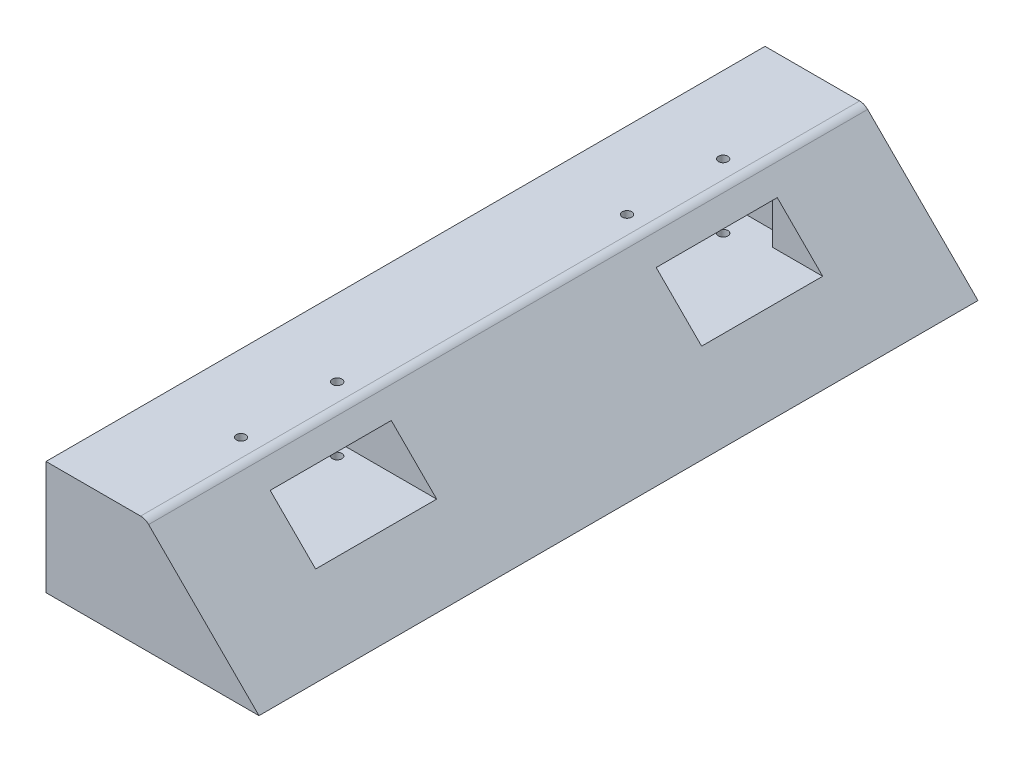
ISO-10303-21;
HEADER;
FILE_DESCRIPTION(('STEP AP214'),'2;1');
FILE_NAME('part.step','',(''),(''),'','','');
FILE_SCHEMA(('AUTOMOTIVE_DESIGN { 1 0 10303 214 1 1 1 1 }'));
ENDSEC;
DATA;
#1=APPLICATION_CONTEXT('core data for automotive mechanical design processes');
#2=APPLICATION_PROTOCOL_DEFINITION('international standard','automotive_design',2000,#1);
#3=PRODUCT_CONTEXT('',#1,'mechanical');
#4=PRODUCT('Part','Part','',(#3));
#5=PRODUCT_RELATED_PRODUCT_CATEGORY('part','',(#4));
#6=PRODUCT_DEFINITION_FORMATION('','',#4);
#7=PRODUCT_DEFINITION_CONTEXT('part definition',#1,'design');
#8=PRODUCT_DEFINITION('design','',#6,#7);
#9=PRODUCT_DEFINITION_SHAPE('','',#8);
#10=(LENGTH_UNIT() NAMED_UNIT(*) SI_UNIT(.MILLI.,.METRE.));
#11=(NAMED_UNIT(*) PLANE_ANGLE_UNIT() SI_UNIT($,.RADIAN.));
#12=(NAMED_UNIT(*) SI_UNIT($,.STERADIAN.) SOLID_ANGLE_UNIT());
#13=UNCERTAINTY_MEASURE_WITH_UNIT(LENGTH_MEASURE(1.E-05),#10,'distance_accuracy_value','');
#14=(GEOMETRIC_REPRESENTATION_CONTEXT(3) GLOBAL_UNCERTAINTY_ASSIGNED_CONTEXT((#13)) GLOBAL_UNIT_ASSIGNED_CONTEXT((#10,
#11,#12)) REPRESENTATION_CONTEXT('',''));
#15=CARTESIAN_POINT('',(0.,0.,0.));
#16=DIRECTION('',(0.,0.,1.));
#17=DIRECTION('',(1.,0.,0.));
#18=AXIS2_PLACEMENT_3D('',#15,#16,#17);
#19=CARTESIAN_POINT('',(20.2426406871193,0.,133.3));
#20=DIRECTION('',(0.,1.,0.));
#21=DIRECTION('',(-1.,0.,0.));
#22=AXIS2_PLACEMENT_3D('',#19,#20,#21);
#23=CYLINDRICAL_SURFACE('',#22,1.25);
#24=CARTESIAN_POINT('',(20.2426406871193,13.0393243800986,133.3));
#25=DIRECTION('',(0.,-1.,0.));
#26=DIRECTION('',(1.,0.,0.));
#27=AXIS2_PLACEMENT_3D('',#24,#25,#26);
#28=CIRCLE('',#27,1.25);
#29=CARTESIAN_POINT('',(21.4926406871193,13.0393243800986,133.3));
#30=VERTEX_POINT('',#29);
#31=EDGE_CURVE('E255',#30,#30,#28,.T.);
#32=ORIENTED_EDGE('',*,*,#31,.F.);
#33=EDGE_LOOP('',(#32));
#34=FACE_BOUND('',#33,.T.);
#35=CARTESIAN_POINT('',(20.2426406871193,8.,133.3));
#36=DIRECTION('',(0.,-1.,0.));
#37=DIRECTION('',(0.,0.,-1.));
#38=AXIS2_PLACEMENT_3D('',#35,#36,#37);
#39=CIRCLE('',#38,1.25);
#40=CARTESIAN_POINT('',(20.2426406871193,8.,132.05));
#41=VERTEX_POINT('',#40);
#42=EDGE_CURVE('E37',#41,#41,#39,.F.);
#43=ORIENTED_EDGE('',*,*,#42,.F.);
#44=EDGE_LOOP('',(#43));
#45=FACE_BOUND('',#44,.T.);
#46=ADVANCED_FACE('F33',(#34,#45),#23,.F.);
#47=CARTESIAN_POINT('',(20.2426406871184,0.,31.2999999999999));
#48=DIRECTION('',(0.,1.,0.));
#49=DIRECTION('',(-1.,0.,0.));
#50=AXIS2_PLACEMENT_3D('',#47,#48,#49);
#51=CYLINDRICAL_SURFACE('',#50,1.25);
#52=CARTESIAN_POINT('',(20.2426406871184,13.0393243800986,31.2999999999999));
#53=DIRECTION('',(0.,-1.,0.));
#54=DIRECTION('',(1.,0.,0.));
#55=AXIS2_PLACEMENT_3D('',#52,#53,#54);
#56=CIRCLE('',#55,1.25);
#57=CARTESIAN_POINT('',(21.4926406871184,13.0393243800986,31.2999999999999));
#58=VERTEX_POINT('',#57);
#59=EDGE_CURVE('E260',#58,#58,#56,.T.);
#60=ORIENTED_EDGE('',*,*,#59,.F.);
#61=EDGE_LOOP('',(#60));
#62=FACE_BOUND('',#61,.T.);
#63=CARTESIAN_POINT('',(20.2426406871184,8.,31.2999999999999));
#64=DIRECTION('',(0.,-1.,0.));
#65=DIRECTION('',(0.,0.,-1.));
#66=AXIS2_PLACEMENT_3D('',#63,#64,#65);
#67=CIRCLE('',#66,1.25);
#68=CARTESIAN_POINT('',(20.2426406871184,8.,30.0499999999999));
#69=VERTEX_POINT('',#68);
#70=EDGE_CURVE('E278',#69,#69,#67,.F.);
#71=ORIENTED_EDGE('',*,*,#70,.F.);
#72=EDGE_LOOP('',(#71));
#73=FACE_BOUND('',#72,.T.);
#74=ADVANCED_FACE('F424',(#62,#73),#51,.F.);
#75=CARTESIAN_POINT('',(20.2426406871183,0.,56.6999999999999));
#76=DIRECTION('',(0.,1.,0.));
#77=DIRECTION('',(-1.,0.,0.));
#78=AXIS2_PLACEMENT_3D('',#75,#76,#77);
#79=CYLINDRICAL_SURFACE('',#78,1.25);
#80=CARTESIAN_POINT('',(20.2426406871183,13.0393243800986,56.6999999999999));
#81=DIRECTION('',(0.,-1.,0.));
#82=DIRECTION('',(1.,0.,0.));
#83=AXIS2_PLACEMENT_3D('',#80,#81,#82);
#84=CIRCLE('',#83,1.25);
#85=CARTESIAN_POINT('',(21.4926406871183,13.0393243800986,56.6999999999999));
#86=VERTEX_POINT('',#85);
#87=EDGE_CURVE('E264',#86,#86,#84,.T.);
#88=ORIENTED_EDGE('',*,*,#87,.F.);
#89=EDGE_LOOP('',(#88));
#90=FACE_BOUND('',#89,.T.);
#91=CARTESIAN_POINT('',(20.2426406871183,8.,56.6999999999999));
#92=DIRECTION('',(0.,-1.,0.));
#93=DIRECTION('',(0.,0.,-1.));
#94=AXIS2_PLACEMENT_3D('',#91,#92,#93);
#95=CIRCLE('',#94,1.25);
#96=CARTESIAN_POINT('',(20.2426406871183,8.,55.4499999999999));
#97=VERTEX_POINT('',#96);
#98=EDGE_CURVE('E275',#97,#97,#95,.F.);
#99=ORIENTED_EDGE('',*,*,#98,.F.);
#100=EDGE_LOOP('',(#99));
#101=FACE_BOUND('',#100,.T.);
#102=ADVANCED_FACE('F431',(#90,#101),#79,.F.);
#103=CARTESIAN_POINT('',(20.2426406871193,0.,158.7));
#104=DIRECTION('',(0.,1.,0.));
#105=DIRECTION('',(-1.,0.,0.));
#106=AXIS2_PLACEMENT_3D('',#103,#104,#105);
#107=CYLINDRICAL_SURFACE('',#106,1.24999999999999);
#108=CARTESIAN_POINT('',(20.2426406871193,13.0393243800986,158.7));
#109=DIRECTION('',(0.,-1.,0.));
#110=DIRECTION('',(1.,0.,0.));
#111=AXIS2_PLACEMENT_3D('',#108,#109,#110);
#112=CIRCLE('',#111,1.24999999999999);
#113=CARTESIAN_POINT('',(21.4926406871193,13.0393243800986,158.7));
#114=VERTEX_POINT('',#113);
#115=EDGE_CURVE('E268',#114,#114,#112,.T.);
#116=ORIENTED_EDGE('',*,*,#115,.F.);
#117=EDGE_LOOP('',(#116));
#118=FACE_BOUND('',#117,.T.);
#119=CARTESIAN_POINT('',(20.2426406871193,8.,158.7));
#120=DIRECTION('',(0.,-1.,0.));
#121=DIRECTION('',(0.,0.,-1.));
#122=AXIS2_PLACEMENT_3D('',#119,#120,#121);
#123=CIRCLE('',#122,1.24999999999999);
#124=CARTESIAN_POINT('',(20.2426406871193,8.,157.45));
#125=VERTEX_POINT('',#124);
#126=EDGE_CURVE('E272',#125,#125,#123,.F.);
#127=ORIENTED_EDGE('',*,*,#126,.F.);
#128=EDGE_LOOP('',(#127));
#129=FACE_BOUND('',#128,.T.);
#130=ADVANCED_FACE('F477',(#118,#129),#107,.F.);
#131=CARTESIAN_POINT('',(56.2819650672182,25.0393243800986,162.));
#132=DIRECTION('',(0.,0.,1.));
#133=DIRECTION('',(1.,0.,0.));
#134=AXIS2_PLACEMENT_3D('',#131,#132,#133);
#135=PLANE('',#134);
#136=DIRECTION('',(0.,-1.,0.));
#137=VECTOR('',#136,1.);
#138=CARTESIAN_POINT('',(30.,25.0393243800986,162.));
#139=LINE('',#138,#137);
#140=CARTESIAN_POINT('',(30.,25.0393243800986,162.));
#141=VERTEX_POINT('',#140);
#142=CARTESIAN_POINT('',(30.,13.0393243800986,162.));
#143=VERTEX_POINT('',#142);
#144=EDGE_CURVE('E50',#141,#143,#139,.T.);
#145=ORIENTED_EDGE('',*,*,#144,.F.);
#146=DIRECTION('',(-1.,0.,0.));
#147=VECTOR('',#146,1.);
#148=CARTESIAN_POINT('',(56.2819650672182,25.0393243800986,162.));
#149=LINE('',#148,#147);
#150=CARTESIAN_POINT('',(31.2426406871193,25.0393243800986,162.));
#151=VERTEX_POINT('',#150);
#152=EDGE_CURVE('E206',#151,#141,#149,.T.);
#153=ORIENTED_EDGE('',*,*,#152,.F.);
#154=DIRECTION('',(-0.707106781186551,0.707106781186544,0.));
#155=VECTOR('',#154,1.);
#156=CARTESIAN_POINT('',(56.2819650672182,0.,162.));
#157=LINE('',#156,#155);
#158=CARTESIAN_POINT('',(43.2426406871194,13.0393243800986,162.));
#159=VERTEX_POINT('',#158);
#160=EDGE_CURVE('E200',#159,#151,#157,.T.);
#161=ORIENTED_EDGE('',*,*,#160,.F.);
#162=DIRECTION('',(1.,0.,0.));
#163=VECTOR('',#162,1.);
#164=CARTESIAN_POINT('',(56.2819650672182,13.0393243800986,162.));
#165=LINE('',#164,#163);
#166=EDGE_CURVE('E11',#143,#159,#165,.T.);
#167=ORIENTED_EDGE('',*,*,#166,.F.);
#168=EDGE_LOOP('',(#145,#153,#161,#167));
#169=FACE_BOUND('',#168,.T.);
#170=ADVANCED_FACE('F396',(#169),#135,.F.);
#171=CARTESIAN_POINT('',(56.2819650672182,25.0393243800986,28.));
#172=DIRECTION('',(0.,0.,-1.));
#173=DIRECTION('',(-1.,0.,0.));
#174=AXIS2_PLACEMENT_3D('',#171,#172,#173);
#175=PLANE('',#174);
#176=DIRECTION('',(1.,0.,0.));
#177=VECTOR('',#176,1.);
#178=CARTESIAN_POINT('',(56.2819650672182,25.0393243800986,28.));
#179=LINE('',#178,#177);
#180=CARTESIAN_POINT('',(30.,25.0393243800986,28.));
#181=VERTEX_POINT('',#180);
#182=CARTESIAN_POINT('',(31.2426406871193,25.0393243800986,28.));
#183=VERTEX_POINT('',#182);
#184=EDGE_CURVE('E173',#181,#183,#179,.T.);
#185=ORIENTED_EDGE('',*,*,#184,.F.);
#186=DIRECTION('',(0.,1.,0.));
#187=VECTOR('',#186,1.);
#188=CARTESIAN_POINT('',(30.,25.0393243800986,28.));
#189=LINE('',#188,#187);
#190=CARTESIAN_POINT('',(30.,13.0393243800986,28.));
#191=VERTEX_POINT('',#190);
#192=EDGE_CURVE('E181',#191,#181,#189,.T.);
#193=ORIENTED_EDGE('',*,*,#192,.F.);
#194=DIRECTION('',(-1.,0.,0.));
#195=VECTOR('',#194,1.);
#196=CARTESIAN_POINT('',(56.2819650672182,13.0393243800986,28.));
#197=LINE('',#196,#195);
#198=CARTESIAN_POINT('',(43.2426406871194,13.0393243800986,28.));
#199=VERTEX_POINT('',#198);
#200=EDGE_CURVE('E343',#199,#191,#197,.T.);
#201=ORIENTED_EDGE('',*,*,#200,.F.);
#202=DIRECTION('',(0.707106781186551,-0.707106781186544,0.));
#203=VECTOR('',#202,1.);
#204=CARTESIAN_POINT('',(56.2819650672182,0.,28.));
#205=LINE('',#204,#203);
#206=EDGE_CURVE('E194',#183,#199,#205,.T.);
#207=ORIENTED_EDGE('',*,*,#206,.F.);
#208=EDGE_LOOP('',(#185,#193,#201,#207));
#209=FACE_BOUND('',#208,.T.);
#210=ADVANCED_FACE('F192',(#209),#175,.F.);
#211=CARTESIAN_POINT('',(56.2819650672182,25.0393243800986,60.));
#212=DIRECTION('',(0.,0.,1.));
#213=DIRECTION('',(1.,0.,0.));
#214=AXIS2_PLACEMENT_3D('',#211,#212,#213);
#215=PLANE('',#214);
#216=DIRECTION('',(1.,0.,0.));
#217=VECTOR('',#216,1.);
#218=CARTESIAN_POINT('',(56.2819650672182,13.0393243800986,60.));
#219=LINE('',#218,#217);
#220=CARTESIAN_POINT('',(15.,13.0393243800987,60.));
#221=VERTEX_POINT('',#220);
#222=CARTESIAN_POINT('',(43.2426406871194,13.0393243800986,60.));
#223=VERTEX_POINT('',#222);
#224=EDGE_CURVE('E341',#221,#223,#219,.T.);
#225=ORIENTED_EDGE('',*,*,#224,.F.);
#226=DIRECTION('',(0.,-1.,0.));
#227=VECTOR('',#226,1.);
#228=CARTESIAN_POINT('',(15.,96.6284296964804,60.));
#229=LINE('',#228,#227);
#230=CARTESIAN_POINT('',(15.,25.0393243800986,60.));
#231=VERTEX_POINT('',#230);
#232=EDGE_CURVE('E351',#231,#221,#229,.T.);
#233=ORIENTED_EDGE('',*,*,#232,.F.);
#234=DIRECTION('',(-1.,0.,0.));
#235=VECTOR('',#234,1.);
#236=CARTESIAN_POINT('',(56.2819650672182,25.0393243800986,60.));
#237=LINE('',#236,#235);
#238=CARTESIAN_POINT('',(31.2426406871193,25.0393243800986,60.));
#239=VERTEX_POINT('',#238);
#240=EDGE_CURVE('E202',#239,#231,#237,.T.);
#241=ORIENTED_EDGE('',*,*,#240,.F.);
#242=DIRECTION('',(-0.707106781186551,0.707106781186544,0.));
#243=VECTOR('',#242,1.);
#244=CARTESIAN_POINT('',(56.2819650672182,0.,60.));
#245=LINE('',#244,#243);
#246=EDGE_CURVE('E217',#223,#239,#245,.T.);
#247=ORIENTED_EDGE('',*,*,#246,.F.);
#248=EDGE_LOOP('',(#225,#233,#241,#247));
#249=FACE_BOUND('',#248,.T.);
#250=ADVANCED_FACE('F374',(#249),#215,.F.);
#251=CARTESIAN_POINT('',(15.,96.6284296964804,130.));
#252=DIRECTION('',(0.707106781186548,0.,-0.707106781186547));
#253=DIRECTION('',(-0.707106781186547,0.,-0.707106781186548));
#254=AXIS2_PLACEMENT_3D('',#251,#252,#253);
#255=PLANE('',#254);
#256=DIRECTION('',(-0.707106781186547,0.,-0.707106781186548));
#257=VECTOR('',#256,1.);
#258=CARTESIAN_POINT('',(15.,13.0393243800987,130.));
#259=LINE('',#258,#257);
#260=CARTESIAN_POINT('',(15.,13.0393243800986,130.));
#261=VERTEX_POINT('',#260);
#262=CARTESIAN_POINT('',(7.92893218813454,13.0393243800987,122.928932188135));
#263=VERTEX_POINT('',#262);
#264=EDGE_CURVE('E339',#261,#263,#259,.T.);
#265=ORIENTED_EDGE('',*,*,#264,.F.);
#266=DIRECTION('',(0.,-1.,0.));
#267=VECTOR('',#266,1.);
#268=CARTESIAN_POINT('',(15.,96.6284296964804,130.));
#269=LINE('',#268,#267);
#270=CARTESIAN_POINT('',(15.,25.0393243800986,130.));
#271=VERTEX_POINT('',#270);
#272=EDGE_CURVE('E355',#271,#261,#269,.T.);
#273=ORIENTED_EDGE('',*,*,#272,.F.);
#274=DIRECTION('',(-0.707106781186547,0.,-0.707106781186548));
#275=VECTOR('',#274,1.);
#276=CARTESIAN_POINT('',(15.,25.0393243800986,130.));
#277=LINE('',#276,#275);
#278=CARTESIAN_POINT('',(7.92893218813454,25.0393243800986,122.928932188135));
#279=VERTEX_POINT('',#278);
#280=EDGE_CURVE('E210',#271,#279,#277,.T.);
#281=ORIENTED_EDGE('',*,*,#280,.T.);
#282=DIRECTION('',(0.,-1.,0.));
#283=VECTOR('',#282,1.);
#284=CARTESIAN_POINT('',(7.92893218813454,96.6284296964804,122.928932188135));
#285=LINE('',#284,#283);
#286=EDGE_CURVE('E359',#279,#263,#285,.T.);
#287=ORIENTED_EDGE('',*,*,#286,.T.);
#288=EDGE_LOOP('',(#265,#273,#281,#287));
#289=FACE_BOUND('',#288,.T.);
#290=ADVANCED_FACE('F385',(#289),#255,.F.);
#291=CARTESIAN_POINT('',(7.92893218813454,96.6284296964804,122.928932188135));
#292=DIRECTION('',(1.,0.,0.));
#293=DIRECTION('',(0.,0.,-1.));
#294=AXIS2_PLACEMENT_3D('',#291,#292,#293);
#295=PLANE('',#294);
#296=DIRECTION('',(0.,0.,-1.));
#297=VECTOR('',#296,1.);
#298=CARTESIAN_POINT('',(7.92893218813454,13.0393243800987,122.928932188135));
#299=LINE('',#298,#297);
#300=CARTESIAN_POINT('',(7.92893218813454,13.0393243800987,67.0710678118655));
#301=VERTEX_POINT('',#300);
#302=EDGE_CURVE('E337',#263,#301,#299,.T.);
#303=ORIENTED_EDGE('',*,*,#302,.F.);
#304=ORIENTED_EDGE('',*,*,#286,.F.);
#305=DIRECTION('',(0.,0.,-1.));
#306=VECTOR('',#305,1.);
#307=CARTESIAN_POINT('',(7.92893218813454,25.0393243800986,122.928932188135));
#308=LINE('',#307,#306);
#309=CARTESIAN_POINT('',(7.92893218813454,25.0393243800986,67.0710678118655));
#310=VERTEX_POINT('',#309);
#311=EDGE_CURVE('E354',#279,#310,#308,.T.);
#312=ORIENTED_EDGE('',*,*,#311,.T.);
#313=DIRECTION('',(0.,-1.,0.));
#314=VECTOR('',#313,1.);
#315=CARTESIAN_POINT('',(7.92893218813454,96.6284296964804,67.0710678118655));
#316=LINE('',#315,#314);
#317=EDGE_CURVE('E362',#310,#301,#316,.T.);
#318=ORIENTED_EDGE('',*,*,#317,.T.);
#319=EDGE_LOOP('',(#303,#304,#312,#318));
#320=FACE_BOUND('',#319,.T.);
#321=ADVANCED_FACE('F380',(#320),#295,.F.);
#322=CARTESIAN_POINT('',(15.,96.6284296964804,60.));
#323=DIRECTION('',(0.707106781186548,0.,0.707106781186547));
#324=DIRECTION('',(0.707106781186547,0.,-0.707106781186548));
#325=AXIS2_PLACEMENT_3D('',#322,#323,#324);
#326=PLANE('',#325);
#327=DIRECTION('',(0.707106781186547,0.,-0.707106781186548));
#328=VECTOR('',#327,1.);
#329=CARTESIAN_POINT('',(15.,13.0393243800987,60.));
#330=LINE('',#329,#328);
#331=EDGE_CURVE('E335',#301,#221,#330,.T.);
#332=ORIENTED_EDGE('',*,*,#331,.F.);
#333=ORIENTED_EDGE('',*,*,#317,.F.);
#334=DIRECTION('',(0.707106781186547,0.,-0.707106781186548));
#335=VECTOR('',#334,1.);
#336=CARTESIAN_POINT('',(15.,25.0393243800986,60.));
#337=LINE('',#336,#335);
#338=EDGE_CURVE('E352',#310,#231,#337,.T.);
#339=ORIENTED_EDGE('',*,*,#338,.T.);
#340=ORIENTED_EDGE('',*,*,#232,.T.);
#341=EDGE_LOOP('',(#332,#333,#339,#340));
#342=FACE_BOUND('',#341,.T.);
#343=ADVANCED_FACE('F377',(#342),#326,.F.);
#344=CARTESIAN_POINT('',(56.2819650672182,25.0393243800986,130.));
#345=DIRECTION('',(0.,0.,-1.));
#346=DIRECTION('',(-1.,0.,0.));
#347=AXIS2_PLACEMENT_3D('',#344,#345,#346);
#348=PLANE('',#347);
#349=DIRECTION('',(-1.,0.,0.));
#350=VECTOR('',#349,1.);
#351=CARTESIAN_POINT('',(0.,13.0393243800986,130.));
#352=LINE('',#351,#350);
#353=CARTESIAN_POINT('',(43.2426406871194,13.0393243800986,130.));
#354=VERTEX_POINT('',#353);
#355=EDGE_CURVE('E58',#354,#261,#352,.T.);
#356=ORIENTED_EDGE('',*,*,#355,.F.);
#357=DIRECTION('',(0.707106781186551,-0.707106781186544,0.));
#358=VECTOR('',#357,1.);
#359=CARTESIAN_POINT('',(56.2819650672182,0.,130.));
#360=LINE('',#359,#358);
#361=CARTESIAN_POINT('',(31.2426406871193,25.0393243800986,130.));
#362=VERTEX_POINT('',#361);
#363=EDGE_CURVE('E213',#362,#354,#360,.T.);
#364=ORIENTED_EDGE('',*,*,#363,.F.);
#365=DIRECTION('',(1.,0.,0.));
#366=VECTOR('',#365,1.);
#367=CARTESIAN_POINT('',(56.2819650672182,25.0393243800986,130.));
#368=LINE('',#367,#366);
#369=EDGE_CURVE('E209',#271,#362,#368,.T.);
#370=ORIENTED_EDGE('',*,*,#369,.F.);
#371=ORIENTED_EDGE('',*,*,#272,.T.);
#372=EDGE_LOOP('',(#356,#364,#370,#371));
#373=FACE_BOUND('',#372,.T.);
#374=ADVANCED_FACE('F386',(#373),#348,.F.);
#375=CARTESIAN_POINT('',(0.,30.0393243800986,190.));
#376=DIRECTION('',(1.,0.,0.));
#377=DIRECTION('',(0.,0.,-1.));
#378=AXIS2_PLACEMENT_3D('',#375,#376,#377);
#379=PLANE('',#378);
#380=DIRECTION('',(0.,-1.,0.));
#381=VECTOR('',#380,1.);
#382=CARTESIAN_POINT('',(0.,30.0393243800986,0.));
#383=LINE('',#382,#381);
#384=CARTESIAN_POINT('',(0.,30.0393243800986,0.));
#385=VERTEX_POINT('',#384);
#386=CARTESIAN_POINT('',(0.,0.,0.));
#387=VERTEX_POINT('',#386);
#388=EDGE_CURVE('E225',#385,#387,#383,.T.);
#389=ORIENTED_EDGE('',*,*,#388,.T.);
#390=DIRECTION('',(0.,0.,-1.));
#391=VECTOR('',#390,1.);
#392=CARTESIAN_POINT('',(0.,0.,190.));
#393=LINE('',#392,#391);
#394=CARTESIAN_POINT('',(0.,0.,190.));
#395=VERTEX_POINT('',#394);
#396=EDGE_CURVE('E233',#395,#387,#393,.T.);
#397=ORIENTED_EDGE('',*,*,#396,.F.);
#398=DIRECTION('',(0.,-1.,0.));
#399=VECTOR('',#398,1.);
#400=CARTESIAN_POINT('',(0.,30.0393243800986,190.));
#401=LINE('',#400,#399);
#402=CARTESIAN_POINT('',(0.,30.0393243800986,190.));
#403=VERTEX_POINT('',#402);
#404=EDGE_CURVE('E231',#403,#395,#401,.T.);
#405=ORIENTED_EDGE('',*,*,#404,.F.);
#406=DIRECTION('',(0.,0.,-1.));
#407=VECTOR('',#406,1.);
#408=CARTESIAN_POINT('',(0.,30.0393243800986,190.));
#409=LINE('',#408,#407);
#410=EDGE_CURVE('E245',#403,#385,#409,.T.);
#411=ORIENTED_EDGE('',*,*,#410,.T.);
#412=EDGE_LOOP('',(#389,#397,#405,#411));
#413=FACE_BOUND('',#412,.T.);
#414=DIRECTION('',(0.,0.,-1.));
#415=VECTOR('',#414,1.);
#416=CARTESIAN_POINT('',(0.,13.0393243800986,190.));
#417=LINE('',#416,#415);
#418=CARTESIAN_POINT('',(0.,13.0393243800986,166.));
#419=VERTEX_POINT('',#418);
#420=CARTESIAN_POINT('',(0.,13.0393243800986,24.));
#421=VERTEX_POINT('',#420);
#422=EDGE_CURVE('E346',#419,#421,#417,.T.);
#423=ORIENTED_EDGE('',*,*,#422,.T.);
#424=DIRECTION('',(0.,-1.,0.));
#425=VECTOR('',#424,1.);
#426=CARTESIAN_POINT('',(0.,25.0393243800986,24.));
#427=LINE('',#426,#425);
#428=CARTESIAN_POINT('',(0.,25.0393243800986,24.));
#429=VERTEX_POINT('',#428);
#430=EDGE_CURVE('E190',#429,#421,#427,.T.);
#431=ORIENTED_EDGE('',*,*,#430,.F.);
#432=DIRECTION('',(0.,0.,-1.));
#433=VECTOR('',#432,1.);
#434=CARTESIAN_POINT('',(0.,25.0393243800986,60.));
#435=LINE('',#434,#433);
#436=CARTESIAN_POINT('',(0.,25.0393243800986,166.));
#437=VERTEX_POINT('',#436);
#438=EDGE_CURVE('E197',#437,#429,#435,.T.);
#439=ORIENTED_EDGE('',*,*,#438,.F.);
#440=DIRECTION('',(0.,1.,0.));
#441=VECTOR('',#440,1.);
#442=CARTESIAN_POINT('',(0.,25.0393243800986,166.));
#443=LINE('',#442,#441);
#444=EDGE_CURVE('E306',#419,#437,#443,.T.);
#445=ORIENTED_EDGE('',*,*,#444,.F.);
#446=EDGE_LOOP('',(#423,#431,#439,#445));
#447=FACE_BOUND('',#446,.T.);
#448=ADVANCED_FACE('F406',(#413,#447),#379,.F.);
#449=CARTESIAN_POINT('',(0.,0.,190.));
#450=DIRECTION('',(0.,1.,0.));
#451=DIRECTION('',(0.,0.,1.));
#452=AXIS2_PLACEMENT_3D('',#449,#450,#451);
#453=PLANE('',#452);
#454=CARTESIAN_POINT('',(20.2426406871193,0.,158.7));
#455=DIRECTION('',(0.,-1.,0.));
#456=DIRECTION('',(0.,0.,-1.));
#457=AXIS2_PLACEMENT_3D('',#454,#455,#456);
#458=CIRCLE('',#457,3.5);
#459=CARTESIAN_POINT('',(20.2426406871193,0.,155.2));
#460=VERTEX_POINT('',#459);
#461=EDGE_CURVE('E597',#460,#460,#458,.T.);
#462=ORIENTED_EDGE('',*,*,#461,.F.);
#463=EDGE_LOOP('',(#462));
#464=FACE_BOUND('',#463,.T.);
#465=CARTESIAN_POINT('',(20.2426406871193,0.,133.3));
#466=DIRECTION('',(0.,-1.,0.));
#467=DIRECTION('',(0.,0.,-1.));
#468=AXIS2_PLACEMENT_3D('',#465,#466,#467);
#469=CIRCLE('',#468,3.49999999999999);
#470=CARTESIAN_POINT('',(20.2426406871193,0.,129.8));
#471=VERTEX_POINT('',#470);
#472=EDGE_CURVE('E591',#471,#471,#469,.T.);
#473=ORIENTED_EDGE('',*,*,#472,.F.);
#474=EDGE_LOOP('',(#473));
#475=FACE_BOUND('',#474,.T.);
#476=CARTESIAN_POINT('',(20.2426406871183,0.,56.6999999999999));
#477=DIRECTION('',(0.,-1.,0.));
#478=DIRECTION('',(0.,0.,-1.));
#479=AXIS2_PLACEMENT_3D('',#476,#477,#478);
#480=CIRCLE('',#479,3.5);
#481=CARTESIAN_POINT('',(20.2426406871183,0.,53.1999999999999));
#482=VERTEX_POINT('',#481);
#483=EDGE_CURVE('E584',#482,#482,#480,.T.);
#484=ORIENTED_EDGE('',*,*,#483,.F.);
#485=EDGE_LOOP('',(#484));
#486=FACE_BOUND('',#485,.T.);
#487=CARTESIAN_POINT('',(20.2426406871184,0.,31.2999999999999));
#488=DIRECTION('',(0.,-1.,0.));
#489=DIRECTION('',(0.,0.,-1.));
#490=AXIS2_PLACEMENT_3D('',#487,#488,#489);
#491=CIRCLE('',#490,3.5);
#492=CARTESIAN_POINT('',(20.2426406871184,0.,27.7999999999999));
#493=VERTEX_POINT('',#492);
#494=EDGE_CURVE('E582',#493,#493,#491,.T.);
#495=ORIENTED_EDGE('',*,*,#494,.F.);
#496=EDGE_LOOP('',(#495));
#497=FACE_BOUND('',#496,.T.);
#498=DIRECTION('',(1.,0.,0.));
#499=VECTOR('',#498,1.);
#500=CARTESIAN_POINT('',(0.,0.,0.));
#501=LINE('',#500,#499);
#502=CARTESIAN_POINT('',(56.2819650672182,0.,0.));
#503=VERTEX_POINT('',#502);
#504=EDGE_CURVE('E220',#387,#503,#501,.T.);
#505=ORIENTED_EDGE('',*,*,#504,.T.);
#506=DIRECTION('',(0.,0.,-1.));
#507=VECTOR('',#506,1.);
#508=CARTESIAN_POINT('',(56.2819650672182,0.,190.));
#509=LINE('',#508,#507);
#510=CARTESIAN_POINT('',(56.2819650672182,0.,190.));
#511=VERTEX_POINT('',#510);
#512=EDGE_CURVE('E42',#511,#503,#509,.T.);
#513=ORIENTED_EDGE('',*,*,#512,.F.);
#514=DIRECTION('',(1.,0.,0.));
#515=VECTOR('',#514,1.);
#516=CARTESIAN_POINT('',(0.,0.,190.));
#517=LINE('',#516,#515);
#518=EDGE_CURVE('E221',#395,#511,#517,.T.);
#519=ORIENTED_EDGE('',*,*,#518,.F.);
#520=ORIENTED_EDGE('',*,*,#396,.T.);
#521=EDGE_LOOP('',(#505,#513,#519,#520));
#522=FACE_BOUND('',#521,.T.);
#523=ADVANCED_FACE('F35',(#464,#475,#486,#497,#522),#453,.F.);
#524=CARTESIAN_POINT('',(56.2819650672182,0.,190.));
#525=DIRECTION('',(-0.707106781186544,-0.707106781186551,0.));
#526=DIRECTION('',(0.707106781186551,-0.707106781186544,0.));
#527=AXIS2_PLACEMENT_3D('',#524,#525,#526);
#528=PLANE('',#527);
#529=ORIENTED_EDGE('',*,*,#206,.T.);
#530=DIRECTION('',(0.,0.,1.));
#531=VECTOR('',#530,1.);
#532=CARTESIAN_POINT('',(43.2426406871194,13.0393243800986,0.));
#533=LINE('',#532,#531);
#534=EDGE_CURVE('E316',#199,#223,#533,.T.);
#535=ORIENTED_EDGE('',*,*,#534,.T.);
#536=ORIENTED_EDGE('',*,*,#246,.T.);
#537=DIRECTION('',(0.,0.,-1.));
#538=VECTOR('',#537,1.);
#539=CARTESIAN_POINT('',(31.2426406871193,25.0393243800986,190.));
#540=LINE('',#539,#538);
#541=EDGE_CURVE('E215',#239,#183,#540,.T.);
#542=ORIENTED_EDGE('',*,*,#541,.T.);
#543=EDGE_LOOP('',(#529,#535,#536,#542));
#544=FACE_BOUND('',#543,.T.);
#545=ORIENTED_EDGE('',*,*,#363,.T.);
#546=DIRECTION('',(0.,0.,-1.));
#547=VECTOR('',#546,1.);
#548=CARTESIAN_POINT('',(43.2426406871195,13.0393243800986,190.));
#549=LINE('',#548,#547);
#550=EDGE_CURVE('E348',#159,#354,#549,.T.);
#551=ORIENTED_EDGE('',*,*,#550,.F.);
#552=ORIENTED_EDGE('',*,*,#160,.T.);
#553=DIRECTION('',(0.,0.,1.));
#554=VECTOR('',#553,1.);
#555=CARTESIAN_POINT('',(31.2426406871193,25.0393243800986,190.));
#556=LINE('',#555,#554);
#557=EDGE_CURVE('E196',#362,#151,#556,.T.);
#558=ORIENTED_EDGE('',*,*,#557,.F.);
#559=EDGE_LOOP('',(#545,#551,#552,#558));
#560=FACE_BOUND('',#559,.T.);
#561=ORIENTED_EDGE('',*,*,#512,.T.);
#562=DIRECTION('',(-0.707106781186551,0.707106781186544,0.));
#563=VECTOR('',#562,1.);
#564=CARTESIAN_POINT('',(56.2819650672182,0.,0.));
#565=LINE('',#564,#563);
#566=CARTESIAN_POINT('',(27.1213203435596,29.1606447236583,0.));
#567=VERTEX_POINT('',#566);
#568=EDGE_CURVE('E236',#503,#567,#565,.T.);
#569=ORIENTED_EDGE('',*,*,#568,.T.);
#570=DIRECTION('',(0.,0.,-1.));
#571=VECTOR('',#570,1.);
#572=CARTESIAN_POINT('',(27.1213203435596,29.1606447236583,190.));
#573=LINE('',#572,#571);
#574=CARTESIAN_POINT('',(27.1213203435596,29.1606447236583,190.));
#575=VERTEX_POINT('',#574);
#576=EDGE_CURVE('E251',#575,#567,#573,.T.);
#577=ORIENTED_EDGE('',*,*,#576,.F.);
#578=DIRECTION('',(-0.707106781186551,0.707106781186544,0.));
#579=VECTOR('',#578,1.);
#580=CARTESIAN_POINT('',(56.2819650672182,0.,190.));
#581=LINE('',#580,#579);
#582=EDGE_CURVE('E224',#511,#575,#581,.T.);
#583=ORIENTED_EDGE('',*,*,#582,.F.);
#584=EDGE_LOOP('',(#561,#569,#577,#583));
#585=FACE_BOUND('',#584,.T.);
#586=ADVANCED_FACE('F390',(#544,#560,#585),#528,.F.);
#587=CARTESIAN_POINT('',(25.,27.0393243800987,190.));
#588=DIRECTION('',(0.,0.,-1.));
#589=DIRECTION('',(-1.,0.,0.));
#590=AXIS2_PLACEMENT_3D('',#587,#588,#589);
#591=CYLINDRICAL_SURFACE('',#590,2.99999999999999);
#592=CARTESIAN_POINT('',(25.,27.0393243800987,0.));
#593=DIRECTION('',(0.,0.,1.));
#594=DIRECTION('',(1.,0.,0.));
#595=AXIS2_PLACEMENT_3D('',#592,#593,#594);
#596=CIRCLE('',#595,2.99999999999999);
#597=CARTESIAN_POINT('',(25.,30.0393243800986,0.));
#598=VERTEX_POINT('',#597);
#599=EDGE_CURVE('E238',#567,#598,#596,.T.);
#600=ORIENTED_EDGE('',*,*,#599,.T.);
#601=DIRECTION('',(0.,0.,-1.));
#602=VECTOR('',#601,1.);
#603=CARTESIAN_POINT('',(25.,30.0393243800986,190.));
#604=LINE('',#603,#602);
#605=CARTESIAN_POINT('',(25.,30.0393243800986,190.));
#606=VERTEX_POINT('',#605);
#607=EDGE_CURVE('E248',#606,#598,#604,.T.);
#608=ORIENTED_EDGE('',*,*,#607,.F.);
#609=CARTESIAN_POINT('',(25.,27.0393243800987,190.));
#610=DIRECTION('',(0.,0.,1.));
#611=DIRECTION('',(1.,0.,0.));
#612=AXIS2_PLACEMENT_3D('',#609,#610,#611);
#613=CIRCLE('',#612,2.99999999999999);
#614=EDGE_CURVE('E227',#575,#606,#613,.T.);
#615=ORIENTED_EDGE('',*,*,#614,.F.);
#616=ORIENTED_EDGE('',*,*,#576,.T.);
#617=EDGE_LOOP('',(#600,#608,#615,#616));
#618=FACE_BOUND('',#617,.T.);
#619=ADVANCED_FACE('F412',(#618),#591,.T.);
#620=CARTESIAN_POINT('',(25.,30.0393243800986,190.));
#621=DIRECTION('',(0.,-1.,0.));
#622=DIRECTION('',(1.,0.,0.));
#623=AXIS2_PLACEMENT_3D('',#620,#621,#622);
#624=PLANE('',#623);
#625=CARTESIAN_POINT('',(20.2426406871193,30.0393243800987,158.7));
#626=DIRECTION('',(0.,1.,0.));
#627=DIRECTION('',(-1.,0.,0.));
#628=AXIS2_PLACEMENT_3D('',#625,#626,#627);
#629=CIRCLE('',#628,1.24999999999999);
#630=CARTESIAN_POINT('',(18.9926406871194,30.0393243800987,158.7));
#631=VERTEX_POINT('',#630);
#632=EDGE_CURVE('E259',#631,#631,#629,.T.);
#633=ORIENTED_EDGE('',*,*,#632,.F.);
#634=EDGE_LOOP('',(#633));
#635=FACE_BOUND('',#634,.T.);
#636=CARTESIAN_POINT('',(20.2426406871183,30.0393243800987,56.6999999999999));
#637=DIRECTION('',(0.,1.,0.));
#638=DIRECTION('',(-1.,0.,0.));
#639=AXIS2_PLACEMENT_3D('',#636,#637,#638);
#640=CIRCLE('',#639,1.25);
#641=CARTESIAN_POINT('',(18.9926406871183,30.0393243800987,56.6999999999999));
#642=VERTEX_POINT('',#641);
#643=EDGE_CURVE('E283',#642,#642,#640,.T.);
#644=ORIENTED_EDGE('',*,*,#643,.F.);
#645=EDGE_LOOP('',(#644));
#646=FACE_BOUND('',#645,.T.);
#647=CARTESIAN_POINT('',(20.2426406871185,30.0393243800987,31.2999999999999));
#648=DIRECTION('',(0.,1.,0.));
#649=DIRECTION('',(-1.,0.,0.));
#650=AXIS2_PLACEMENT_3D('',#647,#648,#649);
#651=CIRCLE('',#650,1.25);
#652=CARTESIAN_POINT('',(18.9926406871184,30.0393243800987,31.2999999999999));
#653=VERTEX_POINT('',#652);
#654=EDGE_CURVE('E287',#653,#653,#651,.T.);
#655=ORIENTED_EDGE('',*,*,#654,.F.);
#656=EDGE_LOOP('',(#655));
#657=FACE_BOUND('',#656,.T.);
#658=CARTESIAN_POINT('',(20.2426406871193,30.0393243800987,133.3));
#659=DIRECTION('',(0.,1.,0.));
#660=DIRECTION('',(-1.,0.,0.));
#661=AXIS2_PLACEMENT_3D('',#658,#659,#660);
#662=CIRCLE('',#661,1.25);
#663=CARTESIAN_POINT('',(18.9926406871193,30.0393243800987,133.3));
#664=VERTEX_POINT('',#663);
#665=EDGE_CURVE('E292',#664,#664,#662,.T.);
#666=ORIENTED_EDGE('',*,*,#665,.F.);
#667=EDGE_LOOP('',(#666));
#668=FACE_BOUND('',#667,.T.);
#669=DIRECTION('',(-1.,0.,0.));
#670=VECTOR('',#669,1.);
#671=CARTESIAN_POINT('',(25.,30.0393243800986,0.));
#672=LINE('',#671,#670);
#673=EDGE_CURVE('E240',#598,#385,#672,.T.);
#674=ORIENTED_EDGE('',*,*,#673,.T.);
#675=ORIENTED_EDGE('',*,*,#410,.F.);
#676=DIRECTION('',(-1.,0.,0.));
#677=VECTOR('',#676,1.);
#678=CARTESIAN_POINT('',(25.,30.0393243800986,190.));
#679=LINE('',#678,#677);
#680=EDGE_CURVE('E229',#606,#403,#679,.T.);
#681=ORIENTED_EDGE('',*,*,#680,.F.);
#682=ORIENTED_EDGE('',*,*,#607,.T.);
#683=EDGE_LOOP('',(#674,#675,#681,#682));
#684=FACE_BOUND('',#683,.T.);
#685=ADVANCED_FACE('F418',(#635,#646,#657,#668,#684),#624,.F.);
#686=CARTESIAN_POINT('',(25.,27.0393243800987,190.));
#687=DIRECTION('',(0.,0.,1.));
#688=DIRECTION('',(1.,0.,0.));
#689=AXIS2_PLACEMENT_3D('',#686,#687,#688);
#690=PLANE('',#689);
#691=ORIENTED_EDGE('',*,*,#582,.T.);
#692=ORIENTED_EDGE('',*,*,#614,.T.);
#693=ORIENTED_EDGE('',*,*,#680,.T.);
#694=ORIENTED_EDGE('',*,*,#404,.T.);
#695=ORIENTED_EDGE('',*,*,#518,.T.);
#696=EDGE_LOOP('',(#691,#692,#693,#694,#695));
#697=FACE_BOUND('',#696,.T.);
#698=ADVANCED_FACE('F462',(#697),#690,.T.);
#699=CARTESIAN_POINT('',(25.,27.0393243800987,0.));
#700=DIRECTION('',(0.,0.,1.));
#701=DIRECTION('',(1.,0.,0.));
#702=AXIS2_PLACEMENT_3D('',#699,#700,#701);
#703=PLANE('',#702);
#704=ORIENTED_EDGE('',*,*,#504,.F.);
#705=ORIENTED_EDGE('',*,*,#388,.F.);
#706=ORIENTED_EDGE('',*,*,#673,.F.);
#707=ORIENTED_EDGE('',*,*,#599,.F.);
#708=ORIENTED_EDGE('',*,*,#568,.F.);
#709=EDGE_LOOP('',(#704,#705,#706,#707,#708));
#710=FACE_BOUND('',#709,.T.);
#711=ADVANCED_FACE('F452',(#710),#703,.F.);
#712=CARTESIAN_POINT('',(0.,25.0393243800986,0.));
#713=DIRECTION('',(0.,1.,0.));
#714=DIRECTION('',(0.,0.,1.));
#715=AXIS2_PLACEMENT_3D('',#712,#713,#714);
#716=PLANE('',#715);
#717=CARTESIAN_POINT('',(20.2426406871193,25.0393243800986,158.7));
#718=DIRECTION('',(0.,1.,0.));
#719=DIRECTION('',(0.,0.,1.));
#720=AXIS2_PLACEMENT_3D('',#717,#718,#719);
#721=CIRCLE('',#720,1.24999999999999);
#722=CARTESIAN_POINT('',(20.2426406871193,25.0393243800986,159.95));
#723=VERTEX_POINT('',#722);
#724=EDGE_CURVE('E271',#723,#723,#721,.T.);
#725=ORIENTED_EDGE('',*,*,#724,.T.);
#726=EDGE_LOOP('',(#725));
#727=FACE_BOUND('',#726,.T.);
#728=CARTESIAN_POINT('',(20.2426406871183,25.0393243800986,56.6999999999999));
#729=DIRECTION('',(0.,1.,0.));
#730=DIRECTION('',(0.,0.,1.));
#731=AXIS2_PLACEMENT_3D('',#728,#729,#730);
#732=CIRCLE('',#731,1.25);
#733=CARTESIAN_POINT('',(20.2426406871183,25.0393243800986,57.9499999999999));
#734=VERTEX_POINT('',#733);
#735=EDGE_CURVE('E267',#734,#734,#732,.T.);
#736=ORIENTED_EDGE('',*,*,#735,.T.);
#737=EDGE_LOOP('',(#736));
#738=FACE_BOUND('',#737,.T.);
#739=CARTESIAN_POINT('',(20.2426406871184,25.0393243800986,31.2999999999999));
#740=DIRECTION('',(0.,1.,0.));
#741=DIRECTION('',(0.,0.,1.));
#742=AXIS2_PLACEMENT_3D('',#739,#740,#741);
#743=CIRCLE('',#742,1.25);
#744=CARTESIAN_POINT('',(20.2426406871184,25.0393243800986,32.5499999999999));
#745=VERTEX_POINT('',#744);
#746=EDGE_CURVE('E263',#745,#745,#743,.T.);
#747=ORIENTED_EDGE('',*,*,#746,.T.);
#748=EDGE_LOOP('',(#747));
#749=FACE_BOUND('',#748,.T.);
#750=CARTESIAN_POINT('',(20.2426406871193,25.0393243800986,133.3));
#751=DIRECTION('',(0.,1.,0.));
#752=DIRECTION('',(0.,0.,1.));
#753=AXIS2_PLACEMENT_3D('',#750,#751,#752);
#754=CIRCLE('',#753,1.25);
#755=CARTESIAN_POINT('',(20.2426406871193,25.0393243800986,134.55));
#756=VERTEX_POINT('',#755);
#757=EDGE_CURVE('E258',#756,#756,#754,.T.);
#758=ORIENTED_EDGE('',*,*,#757,.T.);
#759=EDGE_LOOP('',(#758));
#760=FACE_BOUND('',#759,.T.);
#761=ORIENTED_EDGE('',*,*,#240,.T.);
#762=ORIENTED_EDGE('',*,*,#338,.F.);
#763=ORIENTED_EDGE('',*,*,#311,.F.);
#764=ORIENTED_EDGE('',*,*,#280,.F.);
#765=ORIENTED_EDGE('',*,*,#369,.T.);
#766=ORIENTED_EDGE('',*,*,#557,.T.);
#767=ORIENTED_EDGE('',*,*,#152,.T.);
#768=DIRECTION('',(0.,0.,-1.));
#769=VECTOR('',#768,1.);
#770=CARTESIAN_POINT('',(30.,25.0393243800986,162.));
#771=LINE('',#770,#769);
#772=CARTESIAN_POINT('',(30.,25.0393243800986,166.));
#773=VERTEX_POINT('',#772);
#774=EDGE_CURVE('E324',#773,#141,#771,.T.);
#775=ORIENTED_EDGE('',*,*,#774,.F.);
#776=DIRECTION('',(-1.,0.,0.));
#777=VECTOR('',#776,1.);
#778=CARTESIAN_POINT('',(30.,25.0393243800986,166.));
#779=LINE('',#778,#777);
#780=EDGE_CURVE('E312',#773,#437,#779,.T.);
#781=ORIENTED_EDGE('',*,*,#780,.T.);
#782=ORIENTED_EDGE('',*,*,#438,.T.);
#783=DIRECTION('',(-1.,0.,0.));
#784=VECTOR('',#783,1.);
#785=CARTESIAN_POINT('',(30.,25.0393243800986,24.));
#786=LINE('',#785,#784);
#787=CARTESIAN_POINT('',(30.,25.0393243800986,24.));
#788=VERTEX_POINT('',#787);
#789=EDGE_CURVE('E176',#788,#429,#786,.T.);
#790=ORIENTED_EDGE('',*,*,#789,.F.);
#791=DIRECTION('',(0.,0.,-1.));
#792=VECTOR('',#791,1.);
#793=CARTESIAN_POINT('',(30.,25.0393243800986,28.));
#794=LINE('',#793,#792);
#795=EDGE_CURVE('E167',#181,#788,#794,.T.);
#796=ORIENTED_EDGE('',*,*,#795,.F.);
#797=ORIENTED_EDGE('',*,*,#184,.T.);
#798=ORIENTED_EDGE('',*,*,#541,.F.);
#799=EDGE_LOOP('',(#761,#762,#763,#764,#765,#766,#767,#775,#781,#782,#790,#796,#797,#798));
#800=FACE_BOUND('',#799,.T.);
#801=ADVANCED_FACE('F170',(#727,#738,#749,#760,#800),#716,.F.);
#802=CARTESIAN_POINT('',(0.,13.0393243800986,190.));
#803=DIRECTION('',(0.,-1.,0.));
#804=DIRECTION('',(1.,0.,0.));
#805=AXIS2_PLACEMENT_3D('',#802,#803,#804);
#806=PLANE('',#805);
#807=ORIENTED_EDGE('',*,*,#115,.T.);
#808=EDGE_LOOP('',(#807));
#809=FACE_BOUND('',#808,.T.);
#810=ORIENTED_EDGE('',*,*,#87,.T.);
#811=EDGE_LOOP('',(#810));
#812=FACE_BOUND('',#811,.T.);
#813=ORIENTED_EDGE('',*,*,#59,.T.);
#814=EDGE_LOOP('',(#813));
#815=FACE_BOUND('',#814,.T.);
#816=ORIENTED_EDGE('',*,*,#31,.T.);
#817=EDGE_LOOP('',(#816));
#818=FACE_BOUND('',#817,.T.);
#819=ORIENTED_EDGE('',*,*,#422,.F.);
#820=DIRECTION('',(-1.,0.,0.));
#821=VECTOR('',#820,1.);
#822=CARTESIAN_POINT('',(30.,13.0393243800986,166.));
#823=LINE('',#822,#821);
#824=CARTESIAN_POINT('',(30.,13.0393243800986,166.));
#825=VERTEX_POINT('',#824);
#826=EDGE_CURVE('E326',#825,#419,#823,.T.);
#827=ORIENTED_EDGE('',*,*,#826,.F.);
#828=DIRECTION('',(0.,0.,1.));
#829=VECTOR('',#828,1.);
#830=CARTESIAN_POINT('',(30.,13.0393243800986,162.));
#831=LINE('',#830,#829);
#832=EDGE_CURVE('E319',#143,#825,#831,.T.);
#833=ORIENTED_EDGE('',*,*,#832,.F.);
#834=ORIENTED_EDGE('',*,*,#166,.T.);
#835=ORIENTED_EDGE('',*,*,#550,.T.);
#836=ORIENTED_EDGE('',*,*,#355,.T.);
#837=ORIENTED_EDGE('',*,*,#264,.T.);
#838=ORIENTED_EDGE('',*,*,#302,.T.);
#839=ORIENTED_EDGE('',*,*,#331,.T.);
#840=ORIENTED_EDGE('',*,*,#224,.T.);
#841=ORIENTED_EDGE('',*,*,#534,.F.);
#842=ORIENTED_EDGE('',*,*,#200,.T.);
#843=DIRECTION('',(0.,0.,1.));
#844=VECTOR('',#843,1.);
#845=CARTESIAN_POINT('',(30.,13.0393243800986,28.));
#846=LINE('',#845,#844);
#847=CARTESIAN_POINT('',(30.,13.0393243800986,24.));
#848=VERTEX_POINT('',#847);
#849=EDGE_CURVE('E186',#848,#191,#846,.T.);
#850=ORIENTED_EDGE('',*,*,#849,.F.);
#851=DIRECTION('',(-1.,0.,0.));
#852=VECTOR('',#851,1.);
#853=CARTESIAN_POINT('',(30.,13.0393243800986,24.));
#854=LINE('',#853,#852);
#855=EDGE_CURVE('E313',#848,#421,#854,.T.);
#856=ORIENTED_EDGE('',*,*,#855,.T.);
#857=EDGE_LOOP('',(#819,#827,#833,#834,#835,#836,#837,#838,#839,#840,#841,#842,#850,#856));
#858=FACE_BOUND('',#857,.T.);
#859=ADVANCED_FACE('F399',(#809,#812,#815,#818,#858),#806,.F.);
#860=CARTESIAN_POINT('',(30.,25.0393243800986,166.));
#861=DIRECTION('',(0.,0.,1.));
#862=DIRECTION('',(1.,0.,0.));
#863=AXIS2_PLACEMENT_3D('',#860,#861,#862);
#864=PLANE('',#863);
#865=ORIENTED_EDGE('',*,*,#444,.T.);
#866=ORIENTED_EDGE('',*,*,#780,.F.);
#867=DIRECTION('',(0.,1.,0.));
#868=VECTOR('',#867,1.);
#869=CARTESIAN_POINT('',(30.,25.0393243800986,166.));
#870=LINE('',#869,#868);
#871=EDGE_CURVE('E321',#825,#773,#870,.T.);
#872=ORIENTED_EDGE('',*,*,#871,.F.);
#873=ORIENTED_EDGE('',*,*,#826,.T.);
#874=EDGE_LOOP('',(#865,#866,#872,#873));
#875=FACE_BOUND('',#874,.T.);
#876=ADVANCED_FACE('F404',(#875),#864,.F.);
#877=CARTESIAN_POINT('',(30.,0.,0.));
#878=DIRECTION('',(-1.,0.,0.));
#879=DIRECTION('',(0.,0.,1.));
#880=AXIS2_PLACEMENT_3D('',#877,#878,#879);
#881=PLANE('',#880);
#882=ORIENTED_EDGE('',*,*,#144,.T.);
#883=ORIENTED_EDGE('',*,*,#832,.T.);
#884=ORIENTED_EDGE('',*,*,#871,.T.);
#885=ORIENTED_EDGE('',*,*,#774,.T.);
#886=EDGE_LOOP('',(#882,#883,#884,#885));
#887=FACE_BOUND('',#886,.T.);
#888=ADVANCED_FACE('F401',(#887),#881,.T.);
#889=CARTESIAN_POINT('',(30.,25.0393243800986,24.));
#890=DIRECTION('',(0.,0.,-1.));
#891=DIRECTION('',(-1.,0.,0.));
#892=AXIS2_PLACEMENT_3D('',#889,#890,#891);
#893=PLANE('',#892);
#894=ORIENTED_EDGE('',*,*,#430,.T.);
#895=ORIENTED_EDGE('',*,*,#855,.F.);
#896=DIRECTION('',(0.,-1.,0.));
#897=VECTOR('',#896,1.);
#898=CARTESIAN_POINT('',(30.,25.0393243800986,24.));
#899=LINE('',#898,#897);
#900=EDGE_CURVE('E180',#788,#848,#899,.T.);
#901=ORIENTED_EDGE('',*,*,#900,.F.);
#902=ORIENTED_EDGE('',*,*,#789,.T.);
#903=EDGE_LOOP('',(#894,#895,#901,#902));
#904=FACE_BOUND('',#903,.T.);
#905=ADVANCED_FACE('F409',(#904),#893,.F.);
#906=CARTESIAN_POINT('',(30.,0.,0.));
#907=DIRECTION('',(1.,0.,0.));
#908=DIRECTION('',(0.,0.,-1.));
#909=AXIS2_PLACEMENT_3D('',#906,#907,#908);
#910=PLANE('',#909);
#911=ORIENTED_EDGE('',*,*,#192,.T.);
#912=ORIENTED_EDGE('',*,*,#795,.T.);
#913=ORIENTED_EDGE('',*,*,#900,.T.);
#914=ORIENTED_EDGE('',*,*,#849,.T.);
#915=EDGE_LOOP('',(#911,#912,#913,#914));
#916=FACE_BOUND('',#915,.T.);
#917=ADVANCED_FACE('F184',(#916),#910,.F.);
#918=ORIENTED_EDGE('',*,*,#665,.T.);
#919=EDGE_LOOP('',(#918));
#920=FACE_BOUND('',#919,.T.);
#921=ORIENTED_EDGE('',*,*,#757,.F.);
#922=EDGE_LOOP('',(#921));
#923=FACE_BOUND('',#922,.T.);
#924=ADVANCED_FACE('F427',(#920,#923),#23,.F.);
#925=ORIENTED_EDGE('',*,*,#654,.T.);
#926=EDGE_LOOP('',(#925));
#927=FACE_BOUND('',#926,.T.);
#928=ORIENTED_EDGE('',*,*,#746,.F.);
#929=EDGE_LOOP('',(#928));
#930=FACE_BOUND('',#929,.T.);
#931=ADVANCED_FACE('F434',(#927,#930),#51,.F.);
#932=ORIENTED_EDGE('',*,*,#643,.T.);
#933=EDGE_LOOP('',(#932));
#934=FACE_BOUND('',#933,.T.);
#935=ORIENTED_EDGE('',*,*,#735,.F.);
#936=EDGE_LOOP('',(#935));
#937=FACE_BOUND('',#936,.T.);
#938=ADVANCED_FACE('F444',(#934,#937),#79,.F.);
#939=ORIENTED_EDGE('',*,*,#632,.T.);
#940=EDGE_LOOP('',(#939));
#941=FACE_BOUND('',#940,.T.);
#942=ORIENTED_EDGE('',*,*,#724,.F.);
#943=EDGE_LOOP('',(#942));
#944=FACE_BOUND('',#943,.T.);
#945=ADVANCED_FACE('F515',(#941,#944),#107,.F.);
#946=CARTESIAN_POINT('',(20.2426406871193,8.,158.7));
#947=DIRECTION('',(0.,-1.,0.));
#948=DIRECTION('',(0.,0.,-1.));
#949=AXIS2_PLACEMENT_3D('',#946,#947,#948);
#950=PLANE('',#949);
#951=CARTESIAN_POINT('',(20.2426406871193,8.,158.7));
#952=DIRECTION('',(0.,-1.,0.));
#953=DIRECTION('',(0.,0.,-1.));
#954=AXIS2_PLACEMENT_3D('',#951,#952,#953);
#955=CIRCLE('',#954,3.5);
#956=CARTESIAN_POINT('',(20.2426406871193,8.,155.2));
#957=VERTEX_POINT('',#956);
#958=EDGE_CURVE('E276',#957,#957,#955,.T.);
#959=ORIENTED_EDGE('',*,*,#958,.T.);
#960=EDGE_LOOP('',(#959));
#961=FACE_BOUND('',#960,.T.);
#962=ORIENTED_EDGE('',*,*,#126,.T.);
#963=EDGE_LOOP('',(#962));
#964=FACE_BOUND('',#963,.T.);
#965=ADVANCED_FACE('F518',(#961,#964),#950,.T.);
#966=CARTESIAN_POINT('',(20.2426406871193,8.,158.7));
#967=DIRECTION('',(0.,-1.,0.));
#968=DIRECTION('',(0.,0.,-1.));
#969=AXIS2_PLACEMENT_3D('',#966,#967,#968);
#970=CYLINDRICAL_SURFACE('',#969,3.5);
#971=ORIENTED_EDGE('',*,*,#958,.F.);
#972=EDGE_LOOP('',(#971));
#973=FACE_BOUND('',#972,.T.);
#974=ORIENTED_EDGE('',*,*,#461,.T.);
#975=EDGE_LOOP('',(#974));
#976=FACE_BOUND('',#975,.T.);
#977=ADVANCED_FACE('F525',(#973,#976),#970,.F.);
#978=CARTESIAN_POINT('',(20.2426406871183,8.,56.6999999999999));
#979=DIRECTION('',(0.,-1.,0.));
#980=DIRECTION('',(0.,0.,-1.));
#981=AXIS2_PLACEMENT_3D('',#978,#979,#980);
#982=PLANE('',#981);
#983=CARTESIAN_POINT('',(20.2426406871183,8.,56.6999999999999));
#984=DIRECTION('',(0.,-1.,0.));
#985=DIRECTION('',(0.,0.,-1.));
#986=AXIS2_PLACEMENT_3D('',#983,#984,#985);
#987=CIRCLE('',#986,3.5);
#988=CARTESIAN_POINT('',(20.2426406871183,8.,53.1999999999999));
#989=VERTEX_POINT('',#988);
#990=EDGE_CURVE('E589',#989,#989,#987,.T.);
#991=ORIENTED_EDGE('',*,*,#990,.T.);
#992=EDGE_LOOP('',(#991));
#993=FACE_BOUND('',#992,.T.);
#994=ORIENTED_EDGE('',*,*,#98,.T.);
#995=EDGE_LOOP('',(#994));
#996=FACE_BOUND('',#995,.T.);
#997=ADVANCED_FACE('F547',(#993,#996),#982,.T.);
#998=CARTESIAN_POINT('',(20.2426406871183,8.,56.6999999999999));
#999=DIRECTION('',(0.,-1.,0.));
#1000=DIRECTION('',(0.,0.,-1.));
#1001=AXIS2_PLACEMENT_3D('',#998,#999,#1000);
#1002=CYLINDRICAL_SURFACE('',#1001,3.5);
#1003=ORIENTED_EDGE('',*,*,#990,.F.);
#1004=EDGE_LOOP('',(#1003));
#1005=FACE_BOUND('',#1004,.T.);
#1006=ORIENTED_EDGE('',*,*,#483,.T.);
#1007=EDGE_LOOP('',(#1006));
#1008=FACE_BOUND('',#1007,.T.);
#1009=ADVANCED_FACE('F549',(#1005,#1008),#1002,.F.);
#1010=CARTESIAN_POINT('',(20.2426406871184,8.,31.2999999999999));
#1011=DIRECTION('',(0.,-1.,0.));
#1012=DIRECTION('',(0.,0.,-1.));
#1013=AXIS2_PLACEMENT_3D('',#1010,#1011,#1012);
#1014=PLANE('',#1013);
#1015=CARTESIAN_POINT('',(20.2426406871184,8.,31.2999999999999));
#1016=DIRECTION('',(0.,-1.,0.));
#1017=DIRECTION('',(0.,0.,-1.));
#1018=AXIS2_PLACEMENT_3D('',#1015,#1016,#1017);
#1019=CIRCLE('',#1018,3.5);
#1020=CARTESIAN_POINT('',(20.2426406871184,8.,27.7999999999999));
#1021=VERTEX_POINT('',#1020);
#1022=EDGE_CURVE('E579',#1021,#1021,#1019,.T.);
#1023=ORIENTED_EDGE('',*,*,#1022,.T.);
#1024=EDGE_LOOP('',(#1023));
#1025=FACE_BOUND('',#1024,.T.);
#1026=ORIENTED_EDGE('',*,*,#70,.T.);
#1027=EDGE_LOOP('',(#1026));
#1028=FACE_BOUND('',#1027,.T.);
#1029=ADVANCED_FACE('F556',(#1025,#1028),#1014,.T.);
#1030=CARTESIAN_POINT('',(20.2426406871184,8.,31.2999999999999));
#1031=DIRECTION('',(0.,-1.,0.));
#1032=DIRECTION('',(0.,0.,-1.));
#1033=AXIS2_PLACEMENT_3D('',#1030,#1031,#1032);
#1034=CYLINDRICAL_SURFACE('',#1033,3.5);
#1035=ORIENTED_EDGE('',*,*,#1022,.F.);
#1036=EDGE_LOOP('',(#1035));
#1037=FACE_BOUND('',#1036,.T.);
#1038=ORIENTED_EDGE('',*,*,#494,.T.);
#1039=EDGE_LOOP('',(#1038));
#1040=FACE_BOUND('',#1039,.T.);
#1041=ADVANCED_FACE('F567',(#1037,#1040),#1034,.F.);
#1042=CARTESIAN_POINT('',(20.2426406871193,8.,133.3));
#1043=DIRECTION('',(0.,-1.,0.));
#1044=DIRECTION('',(0.,0.,-1.));
#1045=AXIS2_PLACEMENT_3D('',#1042,#1043,#1044);
#1046=PLANE('',#1045);
#1047=CARTESIAN_POINT('',(20.2426406871193,8.,133.3));
#1048=DIRECTION('',(0.,-1.,0.));
#1049=DIRECTION('',(0.,0.,-1.));
#1050=AXIS2_PLACEMENT_3D('',#1047,#1048,#1049);
#1051=CIRCLE('',#1050,3.49999999999999);
#1052=CARTESIAN_POINT('',(20.2426406871193,8.,129.8));
#1053=VERTEX_POINT('',#1052);
#1054=EDGE_CURVE('E594',#1053,#1053,#1051,.T.);
#1055=ORIENTED_EDGE('',*,*,#1054,.T.);
#1056=EDGE_LOOP('',(#1055));
#1057=FACE_BOUND('',#1056,.T.);
#1058=ORIENTED_EDGE('',*,*,#42,.T.);
#1059=EDGE_LOOP('',(#1058));
#1060=FACE_BOUND('',#1059,.T.);
#1061=ADVANCED_FACE('F570',(#1057,#1060),#1046,.T.);
#1062=CARTESIAN_POINT('',(20.2426406871193,8.,133.3));
#1063=DIRECTION('',(0.,-1.,0.));
#1064=DIRECTION('',(0.,0.,-1.));
#1065=AXIS2_PLACEMENT_3D('',#1062,#1063,#1064);
#1066=CYLINDRICAL_SURFACE('',#1065,3.49999999999999);
#1067=ORIENTED_EDGE('',*,*,#1054,.F.);
#1068=EDGE_LOOP('',(#1067));
#1069=FACE_BOUND('',#1068,.T.);
#1070=ORIENTED_EDGE('',*,*,#472,.T.);
#1071=EDGE_LOOP('',(#1070));
#1072=FACE_BOUND('',#1071,.T.);
#1073=ADVANCED_FACE('F563',(#1069,#1072),#1066,.F.);
#1074=CLOSED_SHELL('',(#46,#74,#102,#130,#170,#210,#250,#290,#321,#343,#374,#448,#523,#586,#619,
#685,#698,#711,#801,#859,#876,#888,#905,#917,#924,#931,#938,#945,#965,#977,#997,#1009,#1029,
#1041,#1061,#1073));
#1075=MANIFOLD_SOLID_BREP('B2',#1074);
#1076=ADVANCED_BREP_SHAPE_REPRESENTATION('',(#18,#1075),#14);
#1077=SHAPE_DEFINITION_REPRESENTATION(#9,#1076);
ENDSEC;
END-ISO-10303-21;
